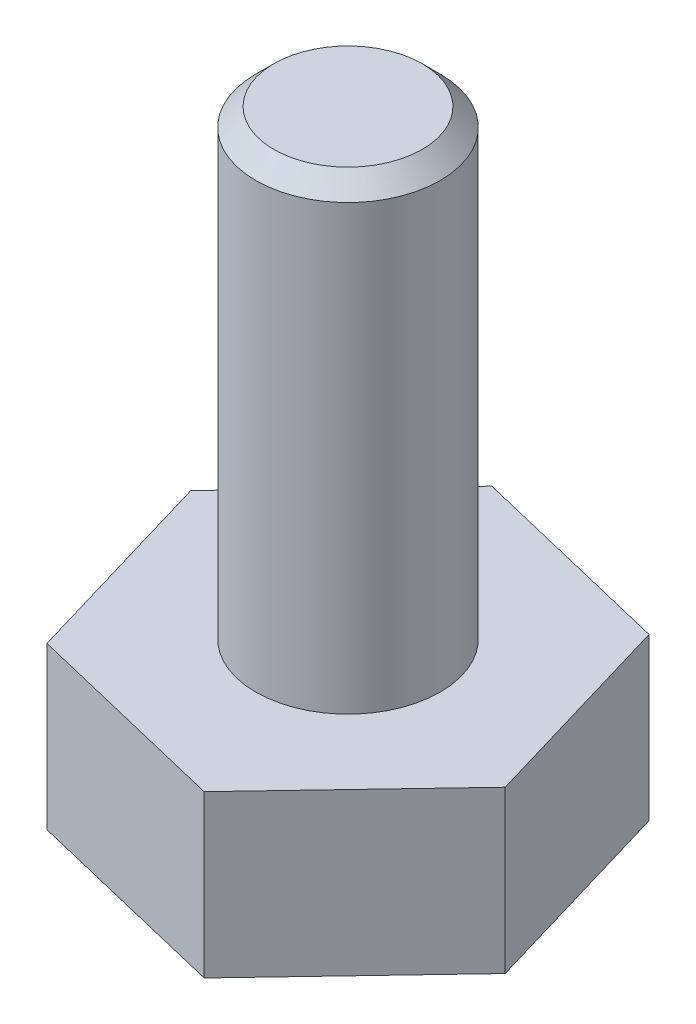
ISO-10303-21;
HEADER;
FILE_DESCRIPTION(('STEP AP214'),'2;1');
FILE_NAME('part.step','',(''),(''),'','','');
FILE_SCHEMA(('AUTOMOTIVE_DESIGN { 1 0 10303 214 1 1 1 1 }'));
ENDSEC;
DATA;
#1=APPLICATION_CONTEXT('core data for automotive mechanical design processes');
#2=APPLICATION_PROTOCOL_DEFINITION('international standard','automotive_design',2000,#1);
#3=PRODUCT_CONTEXT('',#1,'mechanical');
#4=PRODUCT('Part','Part','',(#3));
#5=PRODUCT_RELATED_PRODUCT_CATEGORY('part','',(#4));
#6=PRODUCT_DEFINITION_FORMATION('','',#4);
#7=PRODUCT_DEFINITION_CONTEXT('part definition',#1,'design');
#8=PRODUCT_DEFINITION('design','',#6,#7);
#9=PRODUCT_DEFINITION_SHAPE('','',#8);
#10=(LENGTH_UNIT() NAMED_UNIT(*) SI_UNIT(.MILLI.,.METRE.));
#11=(NAMED_UNIT(*) PLANE_ANGLE_UNIT() SI_UNIT($,.RADIAN.));
#12=(NAMED_UNIT(*) SI_UNIT($,.STERADIAN.) SOLID_ANGLE_UNIT());
#13=UNCERTAINTY_MEASURE_WITH_UNIT(LENGTH_MEASURE(1.E-05),#10,'distance_accuracy_value','');
#14=(GEOMETRIC_REPRESENTATION_CONTEXT(3) GLOBAL_UNCERTAINTY_ASSIGNED_CONTEXT((#13)) GLOBAL_UNIT_ASSIGNED_CONTEXT((#10,
#11,#12)) REPRESENTATION_CONTEXT('',''));
#15=CARTESIAN_POINT('',(0.,0.,0.));
#16=DIRECTION('',(0.,0.,1.));
#17=DIRECTION('',(1.,0.,0.));
#18=AXIS2_PLACEMENT_3D('',#15,#16,#17);
#19=CARTESIAN_POINT('',(-3.18110236489113,3.5,3.34871931899611));
#20=DIRECTION('',(0.23394719336779,0.,-0.972249304816071));
#21=DIRECTION('',(-0.972249304816071,0.,-0.23394719336779));
#22=AXIS2_PLACEMENT_3D('',#19,#20,#21);
#23=PLANE('',#22);
#24=DIRECTION('',(0.972249304816071,0.,0.23394719336779));
#25=VECTOR('',#24,1.);
#26=CARTESIAN_POINT('',(-3.18110236489113,0.,3.34871931899611));
#27=LINE('',#26,#25);
#28=CARTESIAN_POINT('',(-3.18110236489113,0.,3.34871931899611));
#29=VERTEX_POINT('',#28);
#30=CARTESIAN_POINT('',(1.30952481794879,0.,4.42927511953253));
#31=VERTEX_POINT('',#30);
#32=EDGE_CURVE('E121',#29,#31,#27,.T.);
#33=ORIENTED_EDGE('',*,*,#32,.T.);
#34=DIRECTION('',(0.,-1.,0.));
#35=VECTOR('',#34,1.);
#36=CARTESIAN_POINT('',(1.30952481794879,3.5,4.42927511953253));
#37=LINE('',#36,#35);
#38=CARTESIAN_POINT('',(1.30952481794879,3.5,4.42927511953253));
#39=VERTEX_POINT('',#38);
#40=EDGE_CURVE('E11',#39,#31,#37,.T.);
#41=ORIENTED_EDGE('',*,*,#40,.F.);
#42=DIRECTION('',(0.972249304816071,0.,0.23394719336779));
#43=VECTOR('',#42,1.);
#44=CARTESIAN_POINT('',(-3.18110236489113,3.5,3.34871931899611));
#45=LINE('',#44,#43);
#46=CARTESIAN_POINT('',(-3.18110236489113,3.5,3.34871931899611));
#47=VERTEX_POINT('',#46);
#48=EDGE_CURVE('E132',#47,#39,#45,.T.);
#49=ORIENTED_EDGE('',*,*,#48,.F.);
#50=DIRECTION('',(0.,-1.,0.));
#51=VECTOR('',#50,1.);
#52=CARTESIAN_POINT('',(-3.18110236489113,3.5,3.34871931899611));
#53=LINE('',#52,#51);
#54=EDGE_CURVE('E117',#47,#29,#53,.T.);
#55=ORIENTED_EDGE('',*,*,#54,.T.);
#56=EDGE_LOOP('',(#33,#41,#49,#55));
#57=FACE_BOUND('',#56,.T.);
#58=ADVANCED_FACE('F36',(#57),#23,.F.);
#59=CARTESIAN_POINT('',(1.30952481794879,3.5,4.42927511953253));
#60=DIRECTION('',(-0.725019000098582,0.,-0.688728865008612));
#61=DIRECTION('',(-0.688728865008613,0.,0.725019000098583));
#62=AXIS2_PLACEMENT_3D('',#59,#60,#61);
#63=PLANE('',#62);
#64=DIRECTION('',(0.688728865008613,0.,-0.725019000098583));
#65=VECTOR('',#64,1.);
#66=CARTESIAN_POINT('',(1.30952481794879,0.,4.42927511953253));
#67=LINE('',#66,#65);
#68=CARTESIAN_POINT('',(4.49062718283992,0.,1.08055580053642));
#69=VERTEX_POINT('',#68);
#70=EDGE_CURVE('E124',#31,#69,#67,.T.);
#71=ORIENTED_EDGE('',*,*,#70,.T.);
#72=DIRECTION('',(0.,-1.,0.));
#73=VECTOR('',#72,1.);
#74=CARTESIAN_POINT('',(4.49062718283992,3.5,1.08055580053642));
#75=LINE('',#74,#73);
#76=CARTESIAN_POINT('',(4.49062718283992,3.5,1.08055580053642));
#77=VERTEX_POINT('',#76);
#78=EDGE_CURVE('E44',#77,#69,#75,.T.);
#79=ORIENTED_EDGE('',*,*,#78,.F.);
#80=DIRECTION('',(0.688728865008613,0.,-0.725019000098583));
#81=VECTOR('',#80,1.);
#82=CARTESIAN_POINT('',(1.30952481794879,3.5,4.42927511953253));
#83=LINE('',#82,#81);
#84=EDGE_CURVE('E89',#39,#77,#83,.T.);
#85=ORIENTED_EDGE('',*,*,#84,.F.);
#86=ORIENTED_EDGE('',*,*,#40,.T.);
#87=EDGE_LOOP('',(#71,#79,#85,#86));
#88=FACE_BOUND('',#87,.T.);
#89=ADVANCED_FACE('F156',(#88),#63,.F.);
#90=CARTESIAN_POINT('',(4.49062718283992,3.5,1.08055580053642));
#91=DIRECTION('',(-0.958966193466373,0.,0.283520439807459));
#92=DIRECTION('',(0.283520439807459,0.,0.958966193466373));
#93=AXIS2_PLACEMENT_3D('',#90,#91,#92);
#94=PLANE('',#93);
#95=DIRECTION('',(-0.283520439807459,0.,-0.958966193466373));
#96=VECTOR('',#95,1.);
#97=CARTESIAN_POINT('',(4.49062718283992,0.,1.08055580053642));
#98=LINE('',#97,#96);
#99=CARTESIAN_POINT('',(3.18110236489113,0.,-3.34871931899611));
#100=VERTEX_POINT('',#99);
#101=EDGE_CURVE('E127',#69,#100,#98,.T.);
#102=ORIENTED_EDGE('',*,*,#101,.T.);
#103=DIRECTION('',(0.,-1.,0.));
#104=VECTOR('',#103,1.);
#105=CARTESIAN_POINT('',(3.18110236489113,3.5,-3.34871931899611));
#106=LINE('',#105,#104);
#107=CARTESIAN_POINT('',(3.18110236489113,3.5,-3.34871931899611));
#108=VERTEX_POINT('',#107);
#109=EDGE_CURVE('E112',#108,#100,#106,.T.);
#110=ORIENTED_EDGE('',*,*,#109,.F.);
#111=DIRECTION('',(-0.283520439807459,0.,-0.958966193466373));
#112=VECTOR('',#111,1.);
#113=CARTESIAN_POINT('',(4.49062718283992,3.5,1.08055580053642));
#114=LINE('',#113,#112);
#115=EDGE_CURVE('E103',#77,#108,#114,.T.);
#116=ORIENTED_EDGE('',*,*,#115,.F.);
#117=ORIENTED_EDGE('',*,*,#78,.T.);
#118=EDGE_LOOP('',(#102,#110,#116,#117));
#119=FACE_BOUND('',#118,.T.);
#120=ADVANCED_FACE('F138',(#119),#94,.F.);
#121=CARTESIAN_POINT('',(3.18110236489113,3.5,-3.34871931899611));
#122=DIRECTION('',(-0.23394719336779,0.,0.972249304816071));
#123=DIRECTION('',(0.972249304816071,0.,0.233947193367791));
#124=AXIS2_PLACEMENT_3D('',#121,#122,#123);
#125=PLANE('',#124);
#126=DIRECTION('',(-0.972249304816071,0.,-0.23394719336779));
#127=VECTOR('',#126,1.);
#128=CARTESIAN_POINT('',(3.18110236489113,0.,-3.34871931899611));
#129=LINE('',#128,#127);
#130=CARTESIAN_POINT('',(-1.30952481794878,0.,-4.42927511953253));
#131=VERTEX_POINT('',#130);
#132=EDGE_CURVE('E111',#100,#131,#129,.T.);
#133=ORIENTED_EDGE('',*,*,#132,.T.);
#134=DIRECTION('',(0.,-1.,0.));
#135=VECTOR('',#134,1.);
#136=CARTESIAN_POINT('',(-1.30952481794878,3.5,-4.42927511953253));
#137=LINE('',#136,#135);
#138=CARTESIAN_POINT('',(-1.30952481794878,3.5,-4.42927511953253));
#139=VERTEX_POINT('',#138);
#140=EDGE_CURVE('E108',#139,#131,#137,.T.);
#141=ORIENTED_EDGE('',*,*,#140,.F.);
#142=DIRECTION('',(-0.972249304816071,0.,-0.23394719336779));
#143=VECTOR('',#142,1.);
#144=CARTESIAN_POINT('',(3.18110236489113,3.5,-3.34871931899611));
#145=LINE('',#144,#143);
#146=EDGE_CURVE('E96',#108,#139,#145,.T.);
#147=ORIENTED_EDGE('',*,*,#146,.F.);
#148=ORIENTED_EDGE('',*,*,#109,.T.);
#149=EDGE_LOOP('',(#133,#141,#147,#148));
#150=FACE_BOUND('',#149,.T.);
#151=ADVANCED_FACE('F109',(#150),#125,.F.);
#152=CARTESIAN_POINT('',(-1.30952481794878,3.5,-4.42927511953253));
#153=DIRECTION('',(0.725019000098583,0.,0.688728865008612));
#154=DIRECTION('',(0.688728865008612,0.,-0.725019000098583));
#155=AXIS2_PLACEMENT_3D('',#152,#153,#154);
#156=PLANE('',#155);
#157=DIRECTION('',(-0.688728865008612,0.,0.725019000098583));
#158=VECTOR('',#157,1.);
#159=CARTESIAN_POINT('',(-1.30952481794878,0.,-4.42927511953253));
#160=LINE('',#159,#158);
#161=CARTESIAN_POINT('',(-4.49062718283992,0.,-1.08055580053642));
#162=VERTEX_POINT('',#161);
#163=EDGE_CURVE('E75',#131,#162,#160,.T.);
#164=ORIENTED_EDGE('',*,*,#163,.T.);
#165=DIRECTION('',(0.,-1.,0.));
#166=VECTOR('',#165,1.);
#167=CARTESIAN_POINT('',(-4.49062718283992,3.5,-1.08055580053642));
#168=LINE('',#167,#166);
#169=CARTESIAN_POINT('',(-4.49062718283992,3.5,-1.08055580053642));
#170=VERTEX_POINT('',#169);
#171=EDGE_CURVE('E113',#170,#162,#168,.T.);
#172=ORIENTED_EDGE('',*,*,#171,.F.);
#173=DIRECTION('',(-0.688728865008612,0.,0.725019000098583));
#174=VECTOR('',#173,1.);
#175=CARTESIAN_POINT('',(-1.30952481794878,3.5,-4.42927511953253));
#176=LINE('',#175,#174);
#177=EDGE_CURVE('E101',#139,#170,#176,.T.);
#178=ORIENTED_EDGE('',*,*,#177,.F.);
#179=ORIENTED_EDGE('',*,*,#140,.T.);
#180=EDGE_LOOP('',(#164,#172,#178,#179));
#181=FACE_BOUND('',#180,.T.);
#182=ADVANCED_FACE('F115',(#181),#156,.F.);
#183=CARTESIAN_POINT('',(-4.49062718283992,3.5,-1.08055580053642));
#184=DIRECTION('',(0.958966193466373,0.,-0.283520439807459));
#185=DIRECTION('',(-0.283520439807459,0.,-0.958966193466373));
#186=AXIS2_PLACEMENT_3D('',#183,#184,#185);
#187=PLANE('',#186);
#188=DIRECTION('',(0.283520439807459,0.,0.958966193466373));
#189=VECTOR('',#188,1.);
#190=CARTESIAN_POINT('',(-4.49062718283992,0.,-1.08055580053642));
#191=LINE('',#190,#189);
#192=EDGE_CURVE('E81',#162,#29,#191,.T.);
#193=ORIENTED_EDGE('',*,*,#192,.T.);
#194=ORIENTED_EDGE('',*,*,#54,.F.);
#195=DIRECTION('',(0.283520439807459,0.,0.958966193466373));
#196=VECTOR('',#195,1.);
#197=CARTESIAN_POINT('',(-4.49062718283992,3.5,-1.08055580053642));
#198=LINE('',#197,#196);
#199=EDGE_CURVE('E52',#170,#47,#198,.T.);
#200=ORIENTED_EDGE('',*,*,#199,.F.);
#201=ORIENTED_EDGE('',*,*,#171,.T.);
#202=EDGE_LOOP('',(#193,#194,#200,#201));
#203=FACE_BOUND('',#202,.T.);
#204=ADVANCED_FACE('F145',(#203),#187,.F.);
#205=CARTESIAN_POINT('',(0.,3.5,0.));
#206=DIRECTION('',(0.,1.,0.));
#207=DIRECTION('',(0.,0.,1.));
#208=AXIS2_PLACEMENT_3D('',#205,#206,#207);
#209=PLANE('',#208);
#210=ORIENTED_EDGE('',*,*,#48,.T.);
#211=ORIENTED_EDGE('',*,*,#84,.T.);
#212=ORIENTED_EDGE('',*,*,#115,.T.);
#213=ORIENTED_EDGE('',*,*,#146,.T.);
#214=ORIENTED_EDGE('',*,*,#177,.T.);
#215=ORIENTED_EDGE('',*,*,#199,.T.);
#216=EDGE_LOOP('',(#210,#211,#212,#213,#214,#215));
#217=FACE_BOUND('',#216,.T.);
#218=CARTESIAN_POINT('',(0.,3.5,0.));
#219=DIRECTION('',(0.,-1.,0.));
#220=DIRECTION('',(0.,0.,-1.));
#221=AXIS2_PLACEMENT_3D('',#218,#219,#220);
#222=CIRCLE('',#221,2.);
#223=CARTESIAN_POINT('',(0.,3.5,-2.));
#224=VERTEX_POINT('',#223);
#225=EDGE_CURVE('E125',#224,#224,#222,.T.);
#226=ORIENTED_EDGE('',*,*,#225,.T.);
#227=EDGE_LOOP('',(#226));
#228=FACE_BOUND('',#227,.T.);
#229=ADVANCED_FACE('F98',(#217,#228),#209,.T.);
#230=CARTESIAN_POINT('',(0.,0.,0.));
#231=DIRECTION('',(0.,1.,0.));
#232=DIRECTION('',(0.,0.,1.));
#233=AXIS2_PLACEMENT_3D('',#230,#231,#232);
#234=PLANE('',#233);
#235=ORIENTED_EDGE('',*,*,#32,.F.);
#236=ORIENTED_EDGE('',*,*,#192,.F.);
#237=ORIENTED_EDGE('',*,*,#163,.F.);
#238=ORIENTED_EDGE('',*,*,#132,.F.);
#239=ORIENTED_EDGE('',*,*,#101,.F.);
#240=ORIENTED_EDGE('',*,*,#70,.F.);
#241=EDGE_LOOP('',(#235,#236,#237,#238,#239,#240));
#242=FACE_BOUND('',#241,.T.);
#243=ADVANCED_FACE('F141',(#242),#234,.F.);
#244=CARTESIAN_POINT('',(0.,13.5,0.));
#245=DIRECTION('',(0.,-1.,0.));
#246=DIRECTION('',(0.,0.,-1.));
#247=AXIS2_PLACEMENT_3D('',#244,#245,#246);
#248=CYLINDRICAL_SURFACE('',#247,2.);
#249=ORIENTED_EDGE('',*,*,#225,.F.);
#250=EDGE_LOOP('',(#249));
#251=FACE_BOUND('',#250,.T.);
#252=CARTESIAN_POINT('',(0.,13.11,0.));
#253=DIRECTION('',(0.,-1.,0.));
#254=DIRECTION('',(0.,0.,-1.));
#255=AXIS2_PLACEMENT_3D('',#252,#253,#254);
#256=CIRCLE('',#255,2.);
#257=CARTESIAN_POINT('',(0.,13.11,-2.));
#258=VERTEX_POINT('',#257);
#259=EDGE_CURVE('E231',#258,#258,#256,.T.);
#260=ORIENTED_EDGE('',*,*,#259,.T.);
#261=EDGE_LOOP('',(#260));
#262=FACE_BOUND('',#261,.T.);
#263=ADVANCED_FACE('F188',(#251,#262),#248,.T.);
#264=CARTESIAN_POINT('',(0.,13.5,0.));
#265=DIRECTION('',(0.,-1.,0.));
#266=DIRECTION('',(0.,0.,-1.));
#267=AXIS2_PLACEMENT_3D('',#264,#265,#266);
#268=CONICAL_SURFACE('',#267,1.61,0.785398163397449);
#269=ORIENTED_EDGE('',*,*,#259,.F.);
#270=EDGE_LOOP('',(#269));
#271=FACE_BOUND('',#270,.T.);
#272=CARTESIAN_POINT('',(0.,13.5,0.));
#273=DIRECTION('',(0.,-1.,0.));
#274=DIRECTION('',(0.,0.,-1.));
#275=AXIS2_PLACEMENT_3D('',#272,#273,#274);
#276=CIRCLE('',#275,1.61);
#277=CARTESIAN_POINT('',(0.,13.5,-1.61));
#278=VERTEX_POINT('',#277);
#279=EDGE_CURVE('E229',#278,#278,#276,.T.);
#280=ORIENTED_EDGE('',*,*,#279,.T.);
#281=EDGE_LOOP('',(#280));
#282=FACE_BOUND('',#281,.T.);
#283=ADVANCED_FACE('F204',(#271,#282),#268,.T.);
#284=CARTESIAN_POINT('',(0.,13.5,0.));
#285=DIRECTION('',(0.,1.,0.));
#286=DIRECTION('',(0.,0.,1.));
#287=AXIS2_PLACEMENT_3D('',#284,#285,#286);
#288=PLANE('',#287);
#289=ORIENTED_EDGE('',*,*,#279,.F.);
#290=EDGE_LOOP('',(#289));
#291=FACE_BOUND('',#290,.T.);
#292=ADVANCED_FACE('F214',(#291),#288,.T.);
#293=CLOSED_SHELL('',(#58,#89,#120,#151,#182,#204,#229,#243,#263,#283,#292));
#294=MANIFOLD_SOLID_BREP('B2',#293);
#295=ADVANCED_BREP_SHAPE_REPRESENTATION('',(#18,#294),#14);
#296=SHAPE_DEFINITION_REPRESENTATION(#9,#295);
ENDSEC;
END-ISO-10303-21;
